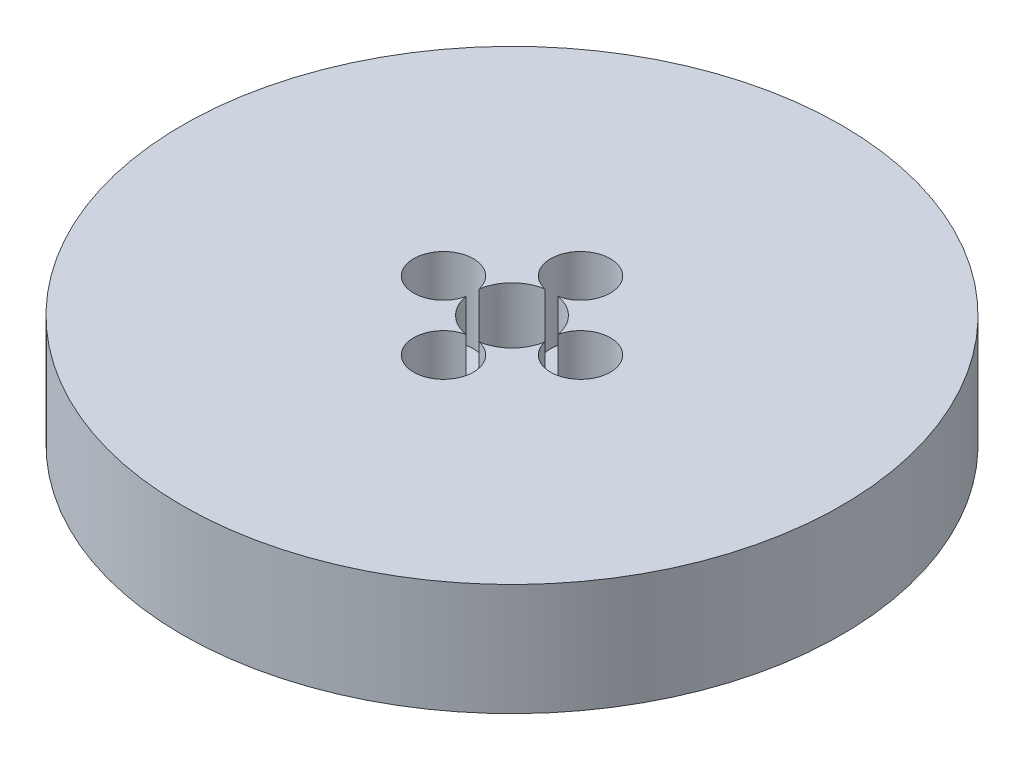
ISO-10303-21;
HEADER;
FILE_DESCRIPTION(('STEP AP214'),'2;1');
FILE_NAME('part.step','',(''),(''),'','','');
FILE_SCHEMA(('AUTOMOTIVE_DESIGN { 1 0 10303 214 1 1 1 1 }'));
ENDSEC;
DATA;
#1=APPLICATION_CONTEXT('core data for automotive mechanical design processes');
#2=APPLICATION_PROTOCOL_DEFINITION('international standard','automotive_design',2000,#1);
#3=PRODUCT_CONTEXT('',#1,'mechanical');
#4=PRODUCT('Part','Part','',(#3));
#5=PRODUCT_RELATED_PRODUCT_CATEGORY('part','',(#4));
#6=PRODUCT_DEFINITION_FORMATION('','',#4);
#7=PRODUCT_DEFINITION_CONTEXT('part definition',#1,'design');
#8=PRODUCT_DEFINITION('design','',#6,#7);
#9=PRODUCT_DEFINITION_SHAPE('','',#8);
#10=(LENGTH_UNIT() NAMED_UNIT(*) SI_UNIT(.MILLI.,.METRE.));
#11=(NAMED_UNIT(*) PLANE_ANGLE_UNIT() SI_UNIT($,.RADIAN.));
#12=(NAMED_UNIT(*) SI_UNIT($,.STERADIAN.) SOLID_ANGLE_UNIT());
#13=UNCERTAINTY_MEASURE_WITH_UNIT(LENGTH_MEASURE(1.E-05),#10,'distance_accuracy_value','');
#14=(GEOMETRIC_REPRESENTATION_CONTEXT(3) GLOBAL_UNCERTAINTY_ASSIGNED_CONTEXT((#13)) GLOBAL_UNIT_ASSIGNED_CONTEXT((#10,
#11,#12)) REPRESENTATION_CONTEXT('',''));
#15=CARTESIAN_POINT('',(0.,0.,0.));
#16=DIRECTION('',(0.,0.,1.));
#17=DIRECTION('',(1.,0.,0.));
#18=AXIS2_PLACEMENT_3D('',#15,#16,#17);
#19=CARTESIAN_POINT('',(0.,28.,0.));
#20=DIRECTION('',(0.,-1.,0.));
#21=DIRECTION('',(0.,0.,-1.));
#22=AXIS2_PLACEMENT_3D('',#19,#20,#21);
#23=CYLINDRICAL_SURFACE('',#22,82.5);
#24=CARTESIAN_POINT('',(0.,28.,0.));
#25=DIRECTION('',(0.,1.,0.));
#26=DIRECTION('',(0.,0.,1.));
#27=AXIS2_PLACEMENT_3D('',#24,#25,#26);
#28=CIRCLE('',#27,82.5);
#29=CARTESIAN_POINT('',(0.,28.,82.5));
#30=VERTEX_POINT('',#29);
#31=EDGE_CURVE('E145',#30,#30,#28,.T.);
#32=ORIENTED_EDGE('',*,*,#31,.F.);
#33=EDGE_LOOP('',(#32));
#34=FACE_BOUND('',#33,.T.);
#35=CARTESIAN_POINT('',(0.,0.,0.));
#36=DIRECTION('',(0.,1.,0.));
#37=DIRECTION('',(0.,0.,1.));
#38=AXIS2_PLACEMENT_3D('',#35,#36,#37);
#39=CIRCLE('',#38,82.5);
#40=CARTESIAN_POINT('',(0.,0.,82.5));
#41=VERTEX_POINT('',#40);
#42=EDGE_CURVE('E143',#41,#41,#39,.T.);
#43=ORIENTED_EDGE('',*,*,#42,.T.);
#44=EDGE_LOOP('',(#43));
#45=FACE_BOUND('',#44,.T.);
#46=ADVANCED_FACE('F39',(#34,#45),#23,.T.);
#47=CARTESIAN_POINT('',(0.,28.,0.));
#48=DIRECTION('',(0.,1.,0.));
#49=DIRECTION('',(0.,0.,1.));
#50=AXIS2_PLACEMENT_3D('',#47,#48,#49);
#51=PLANE('',#50);
#52=CARTESIAN_POINT('',(0.,28.,17.1515110331821));
#53=DIRECTION('',(0.,1.,0.));
#54=DIRECTION('',(1.,0.,0.));
#55=AXIS2_PLACEMENT_3D('',#52,#53,#54);
#56=CIRCLE('',#55,7.4748358210238);
#57=CARTESIAN_POINT('',(-1.65475708082713,28.,9.86213866275731));
#58=VERTEX_POINT('',#57);
#59=CARTESIAN_POINT('',(1.6547570808272,28.,9.8621386627573));
#60=VERTEX_POINT('',#59);
#61=EDGE_CURVE('E152',#58,#60,#56,.T.);
#62=ORIENTED_EDGE('',*,*,#61,.F.);
#63=CARTESIAN_POINT('',(0.,28.,0.));
#64=DIRECTION('',(0.,1.,0.));
#65=DIRECTION('',(0.,0.,1.));
#66=AXIS2_PLACEMENT_3D('',#63,#64,#65);
#67=CIRCLE('',#66,10.);
#68=CARTESIAN_POINT('',(-9.8621386627573,28.,1.65475708082716));
#69=VERTEX_POINT('',#68);
#70=EDGE_CURVE('E133',#69,#58,#67,.T.);
#71=ORIENTED_EDGE('',*,*,#70,.F.);
#72=CARTESIAN_POINT('',(-17.1515110331821,28.,0.));
#73=DIRECTION('',(0.,1.,0.));
#74=DIRECTION('',(0.,0.,1.));
#75=AXIS2_PLACEMENT_3D('',#72,#73,#74);
#76=CIRCLE('',#75,7.4748358210238);
#77=CARTESIAN_POINT('',(-9.8621386627573,28.,-1.65475708082716));
#78=VERTEX_POINT('',#77);
#79=EDGE_CURVE('E128',#78,#69,#76,.T.);
#80=ORIENTED_EDGE('',*,*,#79,.F.);
#81=CARTESIAN_POINT('',(-1.65475708082727,28.,-9.86213866275729));
#82=VERTEX_POINT('',#81);
#83=EDGE_CURVE('E121',#82,#78,#67,.T.);
#84=ORIENTED_EDGE('',*,*,#83,.F.);
#85=CARTESIAN_POINT('',(-1.79652542115953E-13,28.,-17.1515110331821));
#86=DIRECTION('',(0.,1.,0.));
#87=DIRECTION('',(-1.,0.,0.));
#88=AXIS2_PLACEMENT_3D('',#85,#86,#87);
#89=CIRCLE('',#88,7.4748358210238);
#90=CARTESIAN_POINT('',(1.65475708082706,28.,-9.86213866275732));
#91=VERTEX_POINT('',#90);
#92=EDGE_CURVE('E105',#91,#82,#89,.T.);
#93=ORIENTED_EDGE('',*,*,#92,.F.);
#94=CARTESIAN_POINT('',(9.8621386627573,28.,-1.65475708082716));
#95=VERTEX_POINT('',#94);
#96=EDGE_CURVE('E131',#95,#91,#67,.T.);
#97=ORIENTED_EDGE('',*,*,#96,.F.);
#98=CARTESIAN_POINT('',(17.1515110331821,28.,0.));
#99=DIRECTION('',(0.,1.,0.));
#100=DIRECTION('',(0.,0.,-1.));
#101=AXIS2_PLACEMENT_3D('',#98,#99,#100);
#102=CIRCLE('',#101,7.4748358210238);
#103=CARTESIAN_POINT('',(9.8621386627573,28.,1.65475708082716));
#104=VERTEX_POINT('',#103);
#105=EDGE_CURVE('E154',#104,#95,#102,.T.);
#106=ORIENTED_EDGE('',*,*,#105,.F.);
#107=EDGE_CURVE('E134',#60,#104,#67,.T.);
#108=ORIENTED_EDGE('',*,*,#107,.F.);
#109=EDGE_LOOP('',(#62,#71,#80,#84,#93,#97,#106,#108));
#110=FACE_BOUND('',#109,.T.);
#111=ORIENTED_EDGE('',*,*,#31,.T.);
#112=EDGE_LOOP('',(#111));
#113=FACE_BOUND('',#112,.T.);
#114=ADVANCED_FACE('F130',(#110,#113),#51,.T.);
#115=CARTESIAN_POINT('',(0.,0.,0.));
#116=DIRECTION('',(0.,1.,0.));
#117=DIRECTION('',(0.,0.,1.));
#118=AXIS2_PLACEMENT_3D('',#115,#116,#117);
#119=PLANE('',#118);
#120=CARTESIAN_POINT('',(0.,0.,0.));
#121=DIRECTION('',(0.,1.,0.));
#122=DIRECTION('',(0.,0.,1.));
#123=AXIS2_PLACEMENT_3D('',#120,#121,#122);
#124=CIRCLE('',#123,10.);
#125=CARTESIAN_POINT('',(0.,0.,10.));
#126=VERTEX_POINT('',#125);
#127=EDGE_CURVE('E135',#126,#126,#124,.T.);
#128=ORIENTED_EDGE('',*,*,#127,.T.);
#129=EDGE_LOOP('',(#128));
#130=FACE_BOUND('',#129,.T.);
#131=ORIENTED_EDGE('',*,*,#42,.F.);
#132=EDGE_LOOP('',(#131));
#133=FACE_BOUND('',#132,.T.);
#134=ADVANCED_FACE('F195',(#130,#133),#119,.F.);
#135=CARTESIAN_POINT('',(0.,28.,0.));
#136=DIRECTION('',(0.,-1.,0.));
#137=DIRECTION('',(0.,0.,-1.));
#138=AXIS2_PLACEMENT_3D('',#135,#136,#137);
#139=CYLINDRICAL_SURFACE('',#138,10.);
#140=DIRECTION('',(0.,1.,0.));
#141=VECTOR('',#140,1.);
#142=CARTESIAN_POINT('',(-1.65475708082713,18.2308346610595,9.8621386627573));
#143=LINE('',#142,#141);
#144=CARTESIAN_POINT('',(-1.65475708082713,8.46166932211892,9.86213866275731));
#145=VERTEX_POINT('',#144);
#146=EDGE_CURVE('E11',#145,#58,#143,.T.);
#147=ORIENTED_EDGE('',*,*,#146,.F.);
#148=CARTESIAN_POINT('',(0.,8.46166932211892,0.));
#149=DIRECTION('',(0.,1.,0.));
#150=DIRECTION('',(0.,0.,1.));
#151=AXIS2_PLACEMENT_3D('',#148,#149,#150);
#152=CIRCLE('',#151,10.);
#153=CARTESIAN_POINT('',(1.6547570808272,8.46166932211892,9.8621386627573));
#154=VERTEX_POINT('',#153);
#155=EDGE_CURVE('E169',#145,#154,#152,.T.);
#156=ORIENTED_EDGE('',*,*,#155,.T.);
#157=DIRECTION('',(0.,1.,0.));
#158=VECTOR('',#157,1.);
#159=CARTESIAN_POINT('',(1.6547570808272,18.2308346610595,9.86213866275729));
#160=LINE('',#159,#158);
#161=EDGE_CURVE('E46',#60,#154,#160,.F.);
#162=ORIENTED_EDGE('',*,*,#161,.F.);
#163=ORIENTED_EDGE('',*,*,#107,.T.);
#164=DIRECTION('',(0.,1.,0.));
#165=VECTOR('',#164,1.);
#166=CARTESIAN_POINT('',(9.8621386627573,18.2308346610595,1.65475708082716));
#167=LINE('',#166,#165);
#168=CARTESIAN_POINT('',(9.8621386627573,8.46166932211892,1.65475708082716));
#169=VERTEX_POINT('',#168);
#170=EDGE_CURVE('E151',#169,#104,#167,.T.);
#171=ORIENTED_EDGE('',*,*,#170,.F.);
#172=CARTESIAN_POINT('',(0.,8.46166932211892,0.));
#173=DIRECTION('',(0.,1.,0.));
#174=DIRECTION('',(0.,0.,1.));
#175=AXIS2_PLACEMENT_3D('',#172,#173,#174);
#176=CIRCLE('',#175,10.);
#177=CARTESIAN_POINT('',(9.8621386627573,8.46166932211892,-1.65475708082716));
#178=VERTEX_POINT('',#177);
#179=EDGE_CURVE('E173',#169,#178,#176,.T.);
#180=ORIENTED_EDGE('',*,*,#179,.T.);
#181=DIRECTION('',(0.,1.,0.));
#182=VECTOR('',#181,1.);
#183=CARTESIAN_POINT('',(9.8621386627573,18.2308346610595,-1.65475708082716));
#184=LINE('',#183,#182);
#185=EDGE_CURVE('E168',#95,#178,#184,.F.);
#186=ORIENTED_EDGE('',*,*,#185,.F.);
#187=ORIENTED_EDGE('',*,*,#96,.T.);
#188=DIRECTION('',(0.,1.,0.));
#189=VECTOR('',#188,1.);
#190=CARTESIAN_POINT('',(1.65475708082706,18.2308346610595,-9.86213866275732));
#191=LINE('',#190,#189);
#192=CARTESIAN_POINT('',(1.65475708082706,8.46166932211892,-9.86213866275732));
#193=VERTEX_POINT('',#192);
#194=EDGE_CURVE('E108',#193,#91,#191,.T.);
#195=ORIENTED_EDGE('',*,*,#194,.F.);
#196=CARTESIAN_POINT('',(0.,8.46166932211892,0.));
#197=DIRECTION('',(0.,1.,0.));
#198=DIRECTION('',(0.,0.,1.));
#199=AXIS2_PLACEMENT_3D('',#196,#197,#198);
#200=CIRCLE('',#199,10.);
#201=CARTESIAN_POINT('',(-1.65475708082727,8.46166932211892,-9.86213866275729));
#202=VERTEX_POINT('',#201);
#203=EDGE_CURVE('E122',#193,#202,#200,.T.);
#204=ORIENTED_EDGE('',*,*,#203,.T.);
#205=DIRECTION('',(0.,1.,0.));
#206=VECTOR('',#205,1.);
#207=CARTESIAN_POINT('',(-1.65475708082726,18.2308346610595,-9.86213866275728));
#208=LINE('',#207,#206);
#209=EDGE_CURVE('E106',#82,#202,#208,.F.);
#210=ORIENTED_EDGE('',*,*,#209,.F.);
#211=ORIENTED_EDGE('',*,*,#83,.T.);
#212=DIRECTION('',(0.,1.,0.));
#213=VECTOR('',#212,1.);
#214=CARTESIAN_POINT('',(-9.8621386627573,18.2308346610595,-1.65475708082716));
#215=LINE('',#214,#213);
#216=CARTESIAN_POINT('',(-9.8621386627573,8.46166932211892,-1.65475708082716));
#217=VERTEX_POINT('',#216);
#218=EDGE_CURVE('E177',#217,#78,#215,.T.);
#219=ORIENTED_EDGE('',*,*,#218,.F.);
#220=CARTESIAN_POINT('',(0.,8.46166932211892,0.));
#221=DIRECTION('',(0.,1.,0.));
#222=DIRECTION('',(0.,0.,1.));
#223=AXIS2_PLACEMENT_3D('',#220,#221,#222);
#224=CIRCLE('',#223,10.);
#225=CARTESIAN_POINT('',(-9.8621386627573,8.46166932211892,1.65475708082716));
#226=VERTEX_POINT('',#225);
#227=EDGE_CURVE('E185',#217,#226,#224,.T.);
#228=ORIENTED_EDGE('',*,*,#227,.T.);
#229=DIRECTION('',(0.,1.,0.));
#230=VECTOR('',#229,1.);
#231=CARTESIAN_POINT('',(-9.8621386627573,18.2308346610595,1.65475708082716));
#232=LINE('',#231,#230);
#233=EDGE_CURVE('E179',#69,#226,#232,.F.);
#234=ORIENTED_EDGE('',*,*,#233,.F.);
#235=ORIENTED_EDGE('',*,*,#70,.T.);
#236=EDGE_LOOP('',(#147,#156,#162,#163,#171,#180,#186,#187,#195,#204,#210,#211,#219,#228,#234,#235));
#237=FACE_BOUND('',#236,.T.);
#238=ORIENTED_EDGE('',*,*,#127,.F.);
#239=EDGE_LOOP('',(#238));
#240=FACE_BOUND('',#239,.T.);
#241=ADVANCED_FACE('F117',(#237,#240),#139,.F.);
#242=CARTESIAN_POINT('',(-17.1515110331821,8.46166932211892,0.));
#243=DIRECTION('',(0.,1.,0.));
#244=DIRECTION('',(0.,0.,1.));
#245=AXIS2_PLACEMENT_3D('',#242,#243,#244);
#246=CYLINDRICAL_SURFACE('',#245,7.4748358210238);
#247=ORIENTED_EDGE('',*,*,#218,.T.);
#248=ORIENTED_EDGE('',*,*,#79,.T.);
#249=ORIENTED_EDGE('',*,*,#233,.T.);
#250=CARTESIAN_POINT('',(-17.1515110331821,8.46166932211892,0.));
#251=DIRECTION('',(0.,1.,0.));
#252=DIRECTION('',(0.,0.,1.));
#253=AXIS2_PLACEMENT_3D('',#250,#251,#252);
#254=CIRCLE('',#253,7.4748358210238);
#255=EDGE_CURVE('E140',#217,#226,#254,.T.);
#256=ORIENTED_EDGE('',*,*,#255,.F.);
#257=EDGE_LOOP('',(#247,#248,#249,#256));
#258=FACE_BOUND('',#257,.T.);
#259=ADVANCED_FACE('F200',(#258),#246,.F.);
#260=CARTESIAN_POINT('',(-17.1515110331821,8.46166932211892,0.));
#261=DIRECTION('',(0.,1.,0.));
#262=DIRECTION('',(0.,0.,1.));
#263=AXIS2_PLACEMENT_3D('',#260,#261,#262);
#264=PLANE('',#263);
#265=ORIENTED_EDGE('',*,*,#255,.T.);
#266=ORIENTED_EDGE('',*,*,#227,.F.);
#267=EDGE_LOOP('',(#265,#266));
#268=FACE_BOUND('',#267,.T.);
#269=ADVANCED_FACE('F202',(#268),#264,.T.);
#270=CARTESIAN_POINT('',(-1.79652542115953E-13,8.46166932211892,-17.1515110331821));
#271=DIRECTION('',(0.,1.,0.));
#272=DIRECTION('',(0.,0.,1.));
#273=AXIS2_PLACEMENT_3D('',#270,#271,#272);
#274=CYLINDRICAL_SURFACE('',#273,7.4748358210238);
#275=ORIENTED_EDGE('',*,*,#194,.T.);
#276=ORIENTED_EDGE('',*,*,#92,.T.);
#277=ORIENTED_EDGE('',*,*,#209,.T.);
#278=CARTESIAN_POINT('',(-1.79652542115953E-13,8.46166932211892,-17.1515110331821));
#279=DIRECTION('',(0.,1.,0.));
#280=DIRECTION('',(-1.,0.,0.));
#281=AXIS2_PLACEMENT_3D('',#278,#279,#280);
#282=CIRCLE('',#281,7.4748358210238);
#283=EDGE_CURVE('E111',#193,#202,#282,.T.);
#284=ORIENTED_EDGE('',*,*,#283,.F.);
#285=EDGE_LOOP('',(#275,#276,#277,#284));
#286=FACE_BOUND('',#285,.T.);
#287=ADVANCED_FACE('F102',(#286),#274,.F.);
#288=CARTESIAN_POINT('',(-1.79652542115953E-13,8.46166932211892,-17.1515110331821));
#289=DIRECTION('',(0.,1.,0.));
#290=DIRECTION('',(-1.,0.,0.));
#291=AXIS2_PLACEMENT_3D('',#288,#289,#290);
#292=PLANE('',#291);
#293=ORIENTED_EDGE('',*,*,#283,.T.);
#294=ORIENTED_EDGE('',*,*,#203,.F.);
#295=EDGE_LOOP('',(#293,#294));
#296=FACE_BOUND('',#295,.T.);
#297=ADVANCED_FACE('F211',(#296),#292,.T.);
#298=CARTESIAN_POINT('',(17.1515110331821,8.46166932211892,0.));
#299=DIRECTION('',(0.,1.,0.));
#300=DIRECTION('',(0.,0.,1.));
#301=AXIS2_PLACEMENT_3D('',#298,#299,#300);
#302=CYLINDRICAL_SURFACE('',#301,7.4748358210238);
#303=ORIENTED_EDGE('',*,*,#170,.T.);
#304=ORIENTED_EDGE('',*,*,#105,.T.);
#305=ORIENTED_EDGE('',*,*,#185,.T.);
#306=CARTESIAN_POINT('',(17.1515110331821,8.46166932211892,0.));
#307=DIRECTION('',(0.,1.,0.));
#308=DIRECTION('',(0.,0.,-1.));
#309=AXIS2_PLACEMENT_3D('',#306,#307,#308);
#310=CIRCLE('',#309,7.4748358210238);
#311=EDGE_CURVE('E56',#169,#178,#310,.T.);
#312=ORIENTED_EDGE('',*,*,#311,.F.);
#313=EDGE_LOOP('',(#303,#304,#305,#312));
#314=FACE_BOUND('',#313,.T.);
#315=ADVANCED_FACE('F212',(#314),#302,.F.);
#316=CARTESIAN_POINT('',(17.1515110331821,8.46166932211892,0.));
#317=DIRECTION('',(0.,1.,0.));
#318=DIRECTION('',(0.,0.,-1.));
#319=AXIS2_PLACEMENT_3D('',#316,#317,#318);
#320=PLANE('',#319);
#321=ORIENTED_EDGE('',*,*,#311,.T.);
#322=ORIENTED_EDGE('',*,*,#179,.F.);
#323=EDGE_LOOP('',(#321,#322));
#324=FACE_BOUND('',#323,.T.);
#325=ADVANCED_FACE('F217',(#324),#320,.T.);
#326=CARTESIAN_POINT('',(0.,8.46166932211892,17.1515110331821));
#327=DIRECTION('',(0.,1.,0.));
#328=DIRECTION('',(0.,0.,1.));
#329=AXIS2_PLACEMENT_3D('',#326,#327,#328);
#330=CYLINDRICAL_SURFACE('',#329,7.4748358210238);
#331=ORIENTED_EDGE('',*,*,#146,.T.);
#332=ORIENTED_EDGE('',*,*,#61,.T.);
#333=ORIENTED_EDGE('',*,*,#161,.T.);
#334=CARTESIAN_POINT('',(0.,8.46166932211892,17.1515110331821));
#335=DIRECTION('',(0.,1.,0.));
#336=DIRECTION('',(1.,0.,0.));
#337=AXIS2_PLACEMENT_3D('',#334,#335,#336);
#338=CIRCLE('',#337,7.4748358210238);
#339=EDGE_CURVE('E55',#145,#154,#338,.T.);
#340=ORIENTED_EDGE('',*,*,#339,.F.);
#341=EDGE_LOOP('',(#331,#332,#333,#340));
#342=FACE_BOUND('',#341,.T.);
#343=ADVANCED_FACE('F170',(#342),#330,.F.);
#344=CARTESIAN_POINT('',(0.,8.46166932211892,17.1515110331821));
#345=DIRECTION('',(0.,1.,0.));
#346=DIRECTION('',(1.,0.,0.));
#347=AXIS2_PLACEMENT_3D('',#344,#345,#346);
#348=PLANE('',#347);
#349=ORIENTED_EDGE('',*,*,#339,.T.);
#350=ORIENTED_EDGE('',*,*,#155,.F.);
#351=EDGE_LOOP('',(#349,#350));
#352=FACE_BOUND('',#351,.T.);
#353=ADVANCED_FACE('F224',(#352),#348,.T.);
#354=CLOSED_SHELL('',(#46,#114,#134,#241,#259,#269,#287,#297,#315,#325,#343,#353));
#355=MANIFOLD_SOLID_BREP('B2',#354);
#356=ADVANCED_BREP_SHAPE_REPRESENTATION('',(#18,#355),#14);
#357=SHAPE_DEFINITION_REPRESENTATION(#9,#356);
ENDSEC;
END-ISO-10303-21;
